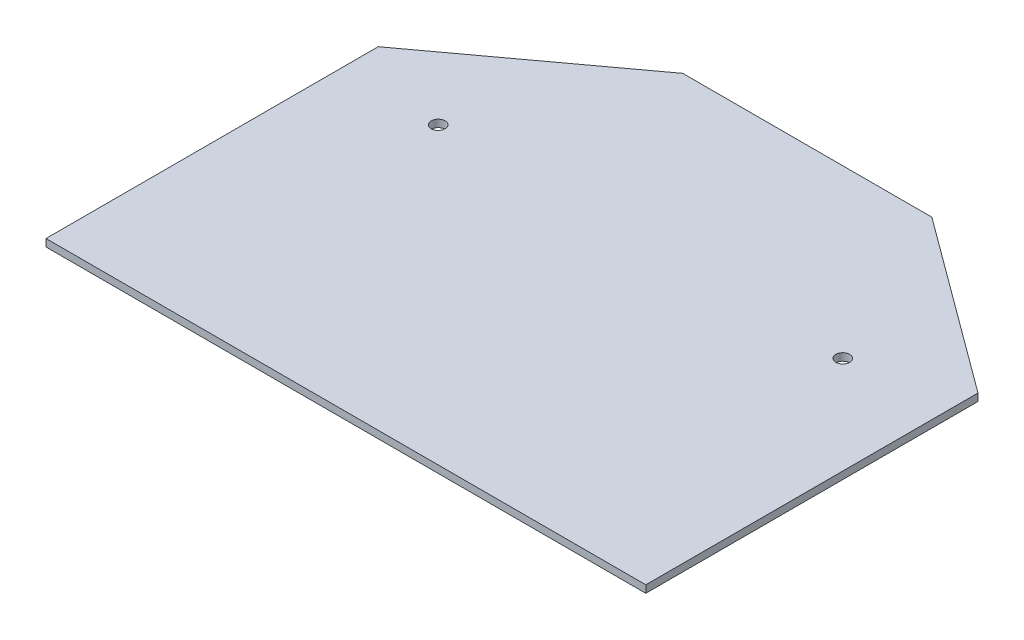
ISO-10303-21;
HEADER;
FILE_DESCRIPTION(('STEP AP214'),'2;1');
FILE_NAME('part.step','',(''),(''),'','','');
FILE_SCHEMA(('AUTOMOTIVE_DESIGN { 1 0 10303 214 1 1 1 1 }'));
ENDSEC;
DATA;
#1=APPLICATION_CONTEXT('core data for automotive mechanical design processes');
#2=APPLICATION_PROTOCOL_DEFINITION('international standard','automotive_design',2000,#1);
#3=PRODUCT_CONTEXT('',#1,'mechanical');
#4=PRODUCT('Part','Part','',(#3));
#5=PRODUCT_RELATED_PRODUCT_CATEGORY('part','',(#4));
#6=PRODUCT_DEFINITION_FORMATION('','',#4);
#7=PRODUCT_DEFINITION_CONTEXT('part definition',#1,'design');
#8=PRODUCT_DEFINITION('design','',#6,#7);
#9=PRODUCT_DEFINITION_SHAPE('','',#8);
#10=(LENGTH_UNIT() NAMED_UNIT(*) SI_UNIT(.MILLI.,.METRE.));
#11=(NAMED_UNIT(*) PLANE_ANGLE_UNIT() SI_UNIT($,.RADIAN.));
#12=(NAMED_UNIT(*) SI_UNIT($,.STERADIAN.) SOLID_ANGLE_UNIT());
#13=UNCERTAINTY_MEASURE_WITH_UNIT(LENGTH_MEASURE(1.E-05),#10,'distance_accuracy_value','');
#14=(GEOMETRIC_REPRESENTATION_CONTEXT(3) GLOBAL_UNCERTAINTY_ASSIGNED_CONTEXT((#13)) GLOBAL_UNIT_ASSIGNED_CONTEXT((#10,
#11,#12)) REPRESENTATION_CONTEXT('',''));
#15=CARTESIAN_POINT('',(0.,0.,0.));
#16=DIRECTION('',(0.,0.,1.));
#17=DIRECTION('',(1.,0.,0.));
#18=AXIS2_PLACEMENT_3D('',#15,#16,#17);
#19=CARTESIAN_POINT('',(0.,1.6,0.));
#20=DIRECTION('',(0.,1.,0.));
#21=DIRECTION('',(0.,0.,1.));
#22=AXIS2_PLACEMENT_3D('',#19,#20,#21);
#23=PLANE('',#22);
#24=DIRECTION('',(1.,0.,0.));
#25=VECTOR('',#24,1.);
#26=CARTESIAN_POINT('',(0.,1.6,20.));
#27=LINE('',#26,#25);
#28=CARTESIAN_POINT('',(-65.,1.6,20.));
#29=VERTEX_POINT('',#28);
#30=CARTESIAN_POINT('',(65.,1.6,20.));
#31=VERTEX_POINT('',#30);
#32=EDGE_CURVE('E93',#29,#31,#27,.T.);
#33=ORIENTED_EDGE('',*,*,#32,.T.);
#34=DIRECTION('',(0.,0.,1.));
#35=VECTOR('',#34,1.);
#36=CARTESIAN_POINT('',(65.,1.6,-52.));
#37=LINE('',#36,#35);
#38=CARTESIAN_POINT('',(65.,1.6,-52.));
#39=VERTEX_POINT('',#38);
#40=EDGE_CURVE('E97',#39,#31,#37,.T.);
#41=ORIENTED_EDGE('',*,*,#40,.F.);
#42=DIRECTION('',(0.805055837353368,0.,0.59319903804985));
#43=VECTOR('',#42,1.);
#44=CARTESIAN_POINT('',(65.,1.6,-52.));
#45=LINE('',#44,#43);
#46=CARTESIAN_POINT('',(27.,1.6,-80.));
#47=VERTEX_POINT('',#46);
#48=EDGE_CURVE('E112',#47,#39,#45,.T.);
#49=ORIENTED_EDGE('',*,*,#48,.F.);
#50=DIRECTION('',(-1.,0.,0.));
#51=VECTOR('',#50,1.);
#52=CARTESIAN_POINT('',(-27.,1.6,-80.));
#53=LINE('',#52,#51);
#54=CARTESIAN_POINT('',(-27.,1.6,-80.));
#55=VERTEX_POINT('',#54);
#56=EDGE_CURVE('E74',#47,#55,#53,.T.);
#57=ORIENTED_EDGE('',*,*,#56,.T.);
#58=DIRECTION('',(-0.805055837353368,0.,0.59319903804985));
#59=VECTOR('',#58,1.);
#60=CARTESIAN_POINT('',(-65.,1.6,-52.));
#61=LINE('',#60,#59);
#62=CARTESIAN_POINT('',(-65.,1.6,-52.));
#63=VERTEX_POINT('',#62);
#64=EDGE_CURVE('E135',#55,#63,#61,.T.);
#65=ORIENTED_EDGE('',*,*,#64,.T.);
#66=DIRECTION('',(0.,0.,1.));
#67=VECTOR('',#66,1.);
#68=CARTESIAN_POINT('',(-65.,1.6,-52.));
#69=LINE('',#68,#67);
#70=EDGE_CURVE('E50',#63,#29,#69,.T.);
#71=ORIENTED_EDGE('',*,*,#70,.T.);
#72=EDGE_LOOP('',(#33,#41,#49,#57,#65,#71));
#73=FACE_BOUND('',#72,.T.);
#74=CARTESIAN_POINT('',(-43.8406204335651,1.6,-43.8406204335669));
#75=DIRECTION('',(0.,1.,0.));
#76=DIRECTION('',(0.,0.,1.));
#77=AXIS2_PLACEMENT_3D('',#74,#75,#76);
#78=CIRCLE('',#77,1.4999999999986);
#79=CARTESIAN_POINT('',(-43.8406204335651,1.6,-42.3406204335683));
#80=VERTEX_POINT('',#79);
#81=EDGE_CURVE('E129',#80,#80,#78,.T.);
#82=ORIENTED_EDGE('',*,*,#81,.F.);
#83=EDGE_LOOP('',(#82));
#84=FACE_BOUND('',#83,.T.);
#85=CARTESIAN_POINT('',(43.8406204335651,1.6,-43.8406204335669));
#86=DIRECTION('',(0.,-1.,0.));
#87=DIRECTION('',(0.,0.,1.));
#88=AXIS2_PLACEMENT_3D('',#85,#86,#87);
#89=CIRCLE('',#88,1.4999999999986);
#90=CARTESIAN_POINT('',(43.8406204335651,1.6,-42.3406204335683));
#91=VERTEX_POINT('',#90);
#92=EDGE_CURVE('E124',#91,#91,#89,.T.);
#93=ORIENTED_EDGE('',*,*,#92,.T.);
#94=EDGE_LOOP('',(#93));
#95=FACE_BOUND('',#94,.T.);
#96=ADVANCED_FACE('F33',(#73,#84,#95),#23,.T.);
#97=CARTESIAN_POINT('',(0.,0.,0.));
#98=DIRECTION('',(0.,1.,0.));
#99=DIRECTION('',(0.,0.,1.));
#100=AXIS2_PLACEMENT_3D('',#97,#98,#99);
#101=PLANE('',#100);
#102=DIRECTION('',(1.,0.,0.));
#103=VECTOR('',#102,1.);
#104=CARTESIAN_POINT('',(0.,0.,20.));
#105=LINE('',#104,#103);
#106=CARTESIAN_POINT('',(-65.,0.,20.));
#107=VERTEX_POINT('',#106);
#108=CARTESIAN_POINT('',(65.,0.,20.));
#109=VERTEX_POINT('',#108);
#110=EDGE_CURVE('E104',#107,#109,#105,.T.);
#111=ORIENTED_EDGE('',*,*,#110,.F.);
#112=DIRECTION('',(0.,0.,1.));
#113=VECTOR('',#112,1.);
#114=CARTESIAN_POINT('',(-65.,0.,-52.));
#115=LINE('',#114,#113);
#116=CARTESIAN_POINT('',(-65.,0.,-52.));
#117=VERTEX_POINT('',#116);
#118=EDGE_CURVE('E69',#117,#107,#115,.T.);
#119=ORIENTED_EDGE('',*,*,#118,.F.);
#120=DIRECTION('',(-0.805055837353368,0.,0.59319903804985));
#121=VECTOR('',#120,1.);
#122=CARTESIAN_POINT('',(-65.,0.,-52.));
#123=LINE('',#122,#121);
#124=CARTESIAN_POINT('',(-27.,0.,-80.));
#125=VERTEX_POINT('',#124);
#126=EDGE_CURVE('E64',#125,#117,#123,.T.);
#127=ORIENTED_EDGE('',*,*,#126,.F.);
#128=DIRECTION('',(-1.,0.,0.));
#129=VECTOR('',#128,1.);
#130=CARTESIAN_POINT('',(-27.,0.,-80.));
#131=LINE('',#130,#129);
#132=CARTESIAN_POINT('',(27.,0.,-80.));
#133=VERTEX_POINT('',#132);
#134=EDGE_CURVE('E140',#133,#125,#131,.T.);
#135=ORIENTED_EDGE('',*,*,#134,.F.);
#136=DIRECTION('',(0.805055837353368,0.,0.59319903804985));
#137=VECTOR('',#136,1.);
#138=CARTESIAN_POINT('',(65.,0.,-52.));
#139=LINE('',#138,#137);
#140=CARTESIAN_POINT('',(65.,0.,-52.));
#141=VERTEX_POINT('',#140);
#142=EDGE_CURVE('E113',#133,#141,#139,.T.);
#143=ORIENTED_EDGE('',*,*,#142,.T.);
#144=DIRECTION('',(0.,0.,1.));
#145=VECTOR('',#144,1.);
#146=CARTESIAN_POINT('',(65.,0.,-52.));
#147=LINE('',#146,#145);
#148=EDGE_CURVE('E118',#141,#109,#147,.T.);
#149=ORIENTED_EDGE('',*,*,#148,.T.);
#150=EDGE_LOOP('',(#111,#119,#127,#135,#143,#149));
#151=FACE_BOUND('',#150,.T.);
#152=CARTESIAN_POINT('',(-43.8406204335651,0.,-43.8406204335669));
#153=DIRECTION('',(0.,1.,0.));
#154=DIRECTION('',(0.,0.,1.));
#155=AXIS2_PLACEMENT_3D('',#152,#153,#154);
#156=CIRCLE('',#155,1.4999999999986);
#157=CARTESIAN_POINT('',(-43.8406204335651,0.,-42.3406204335683));
#158=VERTEX_POINT('',#157);
#159=EDGE_CURVE('E108',#158,#158,#156,.T.);
#160=ORIENTED_EDGE('',*,*,#159,.T.);
#161=EDGE_LOOP('',(#160));
#162=FACE_BOUND('',#161,.T.);
#163=CARTESIAN_POINT('',(43.8406204335651,0.,-43.8406204335669));
#164=DIRECTION('',(0.,-1.,0.));
#165=DIRECTION('',(0.,0.,1.));
#166=AXIS2_PLACEMENT_3D('',#163,#164,#165);
#167=CIRCLE('',#166,1.4999999999986);
#168=CARTESIAN_POINT('',(43.8406204335651,0.,-42.3406204335683));
#169=VERTEX_POINT('',#168);
#170=EDGE_CURVE('E121',#169,#169,#167,.T.);
#171=ORIENTED_EDGE('',*,*,#170,.F.);
#172=EDGE_LOOP('',(#171));
#173=FACE_BOUND('',#172,.T.);
#174=ADVANCED_FACE('F147',(#151,#162,#173),#101,.F.);
#175=CARTESIAN_POINT('',(0.,1.6,20.));
#176=DIRECTION('',(0.,0.,-1.));
#177=DIRECTION('',(-1.,0.,0.));
#178=AXIS2_PLACEMENT_3D('',#175,#176,#177);
#179=PLANE('',#178);
#180=ORIENTED_EDGE('',*,*,#110,.T.);
#181=DIRECTION('',(0.,-1.,0.));
#182=VECTOR('',#181,1.);
#183=CARTESIAN_POINT('',(65.,1.6,20.));
#184=LINE('',#183,#182);
#185=EDGE_CURVE('E102',#31,#109,#184,.T.);
#186=ORIENTED_EDGE('',*,*,#185,.F.);
#187=ORIENTED_EDGE('',*,*,#32,.F.);
#188=DIRECTION('',(0.,-1.,0.));
#189=VECTOR('',#188,1.);
#190=CARTESIAN_POINT('',(-65.,1.6,20.));
#191=LINE('',#190,#189);
#192=EDGE_CURVE('E138',#29,#107,#191,.T.);
#193=ORIENTED_EDGE('',*,*,#192,.T.);
#194=EDGE_LOOP('',(#180,#186,#187,#193));
#195=FACE_BOUND('',#194,.T.);
#196=ADVANCED_FACE('F35',(#195),#179,.F.);
#197=CARTESIAN_POINT('',(-27.,1.6,-80.));
#198=DIRECTION('',(0.,0.,1.));
#199=DIRECTION('',(1.,0.,0.));
#200=AXIS2_PLACEMENT_3D('',#197,#198,#199);
#201=PLANE('',#200);
#202=ORIENTED_EDGE('',*,*,#134,.T.);
#203=DIRECTION('',(0.,-1.,0.));
#204=VECTOR('',#203,1.);
#205=CARTESIAN_POINT('',(-27.,1.6,-80.));
#206=LINE('',#205,#204);
#207=EDGE_CURVE('E11',#55,#125,#206,.T.);
#208=ORIENTED_EDGE('',*,*,#207,.F.);
#209=ORIENTED_EDGE('',*,*,#56,.F.);
#210=DIRECTION('',(0.,-1.,0.));
#211=VECTOR('',#210,1.);
#212=CARTESIAN_POINT('',(27.,1.6,-80.));
#213=LINE('',#212,#211);
#214=EDGE_CURVE('E115',#47,#133,#213,.T.);
#215=ORIENTED_EDGE('',*,*,#214,.T.);
#216=EDGE_LOOP('',(#202,#208,#209,#215));
#217=FACE_BOUND('',#216,.T.);
#218=ADVANCED_FACE('F154',(#217),#201,.F.);
#219=CARTESIAN_POINT('',(-65.,1.6,-52.));
#220=DIRECTION('',(0.59319903804985,0.,0.805055837353368));
#221=DIRECTION('',(0.805055837353368,0.,-0.59319903804985));
#222=AXIS2_PLACEMENT_3D('',#219,#220,#221);
#223=PLANE('',#222);
#224=ORIENTED_EDGE('',*,*,#126,.T.);
#225=DIRECTION('',(0.,-1.,0.));
#226=VECTOR('',#225,1.);
#227=CARTESIAN_POINT('',(-65.,1.6,-52.));
#228=LINE('',#227,#226);
#229=EDGE_CURVE('E42',#63,#117,#228,.T.);
#230=ORIENTED_EDGE('',*,*,#229,.F.);
#231=ORIENTED_EDGE('',*,*,#64,.F.);
#232=ORIENTED_EDGE('',*,*,#207,.T.);
#233=EDGE_LOOP('',(#224,#230,#231,#232));
#234=FACE_BOUND('',#233,.T.);
#235=ADVANCED_FACE('F155',(#234),#223,.F.);
#236=CARTESIAN_POINT('',(-65.,1.6,-52.));
#237=DIRECTION('',(1.,0.,0.));
#238=DIRECTION('',(0.,0.,-1.));
#239=AXIS2_PLACEMENT_3D('',#236,#237,#238);
#240=PLANE('',#239);
#241=ORIENTED_EDGE('',*,*,#118,.T.);
#242=ORIENTED_EDGE('',*,*,#192,.F.);
#243=ORIENTED_EDGE('',*,*,#70,.F.);
#244=ORIENTED_EDGE('',*,*,#229,.T.);
#245=EDGE_LOOP('',(#241,#242,#243,#244));
#246=FACE_BOUND('',#245,.T.);
#247=ADVANCED_FACE('F144',(#246),#240,.F.);
#248=CARTESIAN_POINT('',(-43.8406204335651,1.6,-43.8406204335669));
#249=DIRECTION('',(0.,-1.,0.));
#250=DIRECTION('',(0.,0.,-1.));
#251=AXIS2_PLACEMENT_3D('',#248,#249,#250);
#252=CYLINDRICAL_SURFACE('',#251,1.4999999999986);
#253=ORIENTED_EDGE('',*,*,#81,.T.);
#254=EDGE_LOOP('',(#253));
#255=FACE_BOUND('',#254,.T.);
#256=ORIENTED_EDGE('',*,*,#159,.F.);
#257=EDGE_LOOP('',(#256));
#258=FACE_BOUND('',#257,.T.);
#259=ADVANCED_FACE('F162',(#255,#258),#252,.F.);
#260=CARTESIAN_POINT('',(65.,1.6,-52.));
#261=DIRECTION('',(1.,0.,0.));
#262=DIRECTION('',(0.,0.,-1.));
#263=AXIS2_PLACEMENT_3D('',#260,#261,#262);
#264=PLANE('',#263);
#265=ORIENTED_EDGE('',*,*,#148,.F.);
#266=DIRECTION('',(0.,-1.,0.));
#267=VECTOR('',#266,1.);
#268=CARTESIAN_POINT('',(65.,1.6,-52.));
#269=LINE('',#268,#267);
#270=EDGE_CURVE('E109',#39,#141,#269,.T.);
#271=ORIENTED_EDGE('',*,*,#270,.F.);
#272=ORIENTED_EDGE('',*,*,#40,.T.);
#273=ORIENTED_EDGE('',*,*,#185,.T.);
#274=EDGE_LOOP('',(#265,#271,#272,#273));
#275=FACE_BOUND('',#274,.T.);
#276=ADVANCED_FACE('F111',(#275),#264,.T.);
#277=CARTESIAN_POINT('',(65.,1.6,-52.));
#278=DIRECTION('',(0.59319903804985,0.,-0.805055837353368));
#279=DIRECTION('',(-0.805055837353368,0.,-0.59319903804985));
#280=AXIS2_PLACEMENT_3D('',#277,#278,#279);
#281=PLANE('',#280);
#282=ORIENTED_EDGE('',*,*,#142,.F.);
#283=ORIENTED_EDGE('',*,*,#214,.F.);
#284=ORIENTED_EDGE('',*,*,#48,.T.);
#285=ORIENTED_EDGE('',*,*,#270,.T.);
#286=EDGE_LOOP('',(#282,#283,#284,#285));
#287=FACE_BOUND('',#286,.T.);
#288=ADVANCED_FACE('F152',(#287),#281,.T.);
#289=CARTESIAN_POINT('',(43.8406204335651,1.6,-43.8406204335669));
#290=DIRECTION('',(0.,-1.,0.));
#291=DIRECTION('',(0.,0.,-1.));
#292=AXIS2_PLACEMENT_3D('',#289,#290,#291);
#293=CYLINDRICAL_SURFACE('',#292,1.4999999999986);
#294=ORIENTED_EDGE('',*,*,#92,.F.);
#295=EDGE_LOOP('',(#294));
#296=FACE_BOUND('',#295,.T.);
#297=ORIENTED_EDGE('',*,*,#170,.T.);
#298=EDGE_LOOP('',(#297));
#299=FACE_BOUND('',#298,.T.);
#300=ADVANCED_FACE('F178',(#296,#299),#293,.F.);
#301=CLOSED_SHELL('',(#96,#174,#196,#218,#235,#247,#259,#276,#288,#300));
#302=MANIFOLD_SOLID_BREP('B2',#301);
#303=ADVANCED_BREP_SHAPE_REPRESENTATION('',(#18,#302),#14);
#304=SHAPE_DEFINITION_REPRESENTATION(#9,#303);
ENDSEC;
END-ISO-10303-21;
